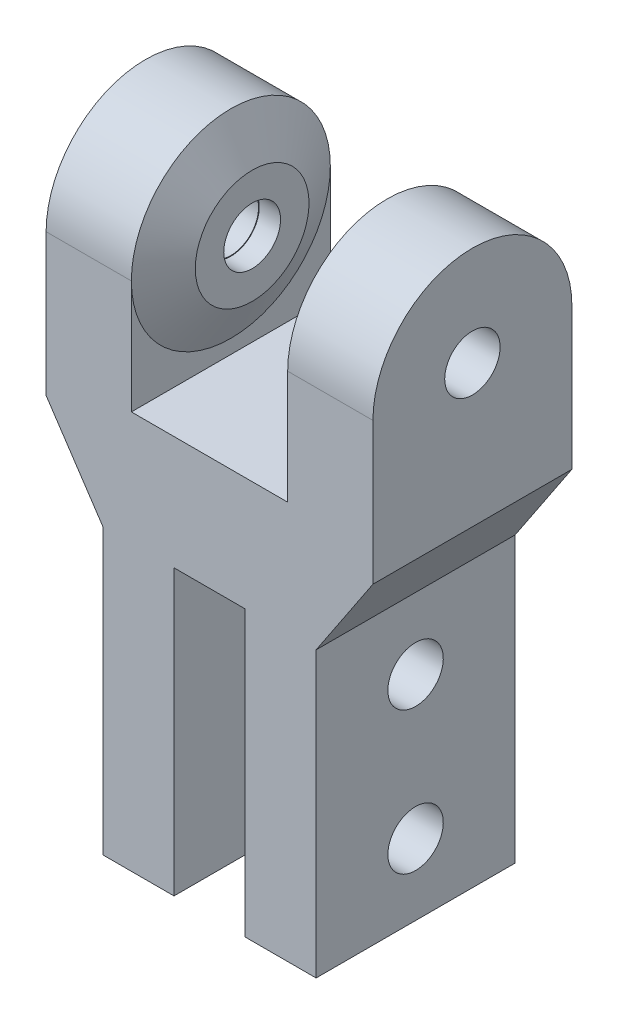
ISO-10303-21;
HEADER;
FILE_DESCRIPTION(('STEP AP214'),'2;1');
FILE_NAME('part.step','',(''),(''),'','','');
FILE_SCHEMA(('AUTOMOTIVE_DESIGN { 1 0 10303 214 1 1 1 1 }'));
ENDSEC;
DATA;
#1=APPLICATION_CONTEXT('core data for automotive mechanical design processes');
#2=APPLICATION_PROTOCOL_DEFINITION('international standard','automotive_design',2000,#1);
#3=PRODUCT_CONTEXT('',#1,'mechanical');
#4=PRODUCT('Part','Part','',(#3));
#5=PRODUCT_RELATED_PRODUCT_CATEGORY('part','',(#4));
#6=PRODUCT_DEFINITION_FORMATION('','',#4);
#7=PRODUCT_DEFINITION_CONTEXT('part definition',#1,'design');
#8=PRODUCT_DEFINITION('design','',#6,#7);
#9=PRODUCT_DEFINITION_SHAPE('','',#8);
#10=(LENGTH_UNIT() NAMED_UNIT(*) SI_UNIT(.MILLI.,.METRE.));
#11=(NAMED_UNIT(*) PLANE_ANGLE_UNIT() SI_UNIT($,.RADIAN.));
#12=(NAMED_UNIT(*) SI_UNIT($,.STERADIAN.) SOLID_ANGLE_UNIT());
#13=UNCERTAINTY_MEASURE_WITH_UNIT(LENGTH_MEASURE(1.E-05),#10,'distance_accuracy_value','');
#14=(GEOMETRIC_REPRESENTATION_CONTEXT(3) GLOBAL_UNCERTAINTY_ASSIGNED_CONTEXT((#13)) GLOBAL_UNIT_ASSIGNED_CONTEXT((#10,
#11,#12)) REPRESENTATION_CONTEXT('',''));
#15=CARTESIAN_POINT('',(0.,0.,0.));
#16=DIRECTION('',(0.,0.,1.));
#17=DIRECTION('',(1.,0.,0.));
#18=AXIS2_PLACEMENT_3D('',#15,#16,#17);
#19=CARTESIAN_POINT('',(2.75,12.,3.5));
#20=DIRECTION('',(1.,0.,0.));
#21=DIRECTION('',(0.,1.,0.));
#22=AXIS2_PLACEMENT_3D('',#19,#20,#21);
#23=PLANE('',#22);
#24=CARTESIAN_POINT('',(2.75,7.99124609126837,0.));
#25=DIRECTION('',(-1.,0.,0.));
#26=DIRECTION('',(0.,0.,1.));
#27=AXIS2_PLACEMENT_3D('',#24,#25,#26);
#28=CIRCLE('',#27,3.5);
#29=CARTESIAN_POINT('',(2.75,7.99124609126837,-3.5));
#30=VERTEX_POINT('',#29);
#31=CARTESIAN_POINT('',(2.75,7.99124609126837,3.5));
#32=VERTEX_POINT('',#31);
#33=EDGE_CURVE('E173',#30,#32,#28,.T.);
#34=ORIENTED_EDGE('',*,*,#33,.F.);
#35=DIRECTION('',(0.,-1.,0.));
#36=VECTOR('',#35,1.);
#37=CARTESIAN_POINT('',(2.75,12.,-3.5));
#38=LINE('',#37,#36);
#39=CARTESIAN_POINT('',(2.75,4.,-3.5));
#40=VERTEX_POINT('',#39);
#41=EDGE_CURVE('E181',#30,#40,#38,.T.);
#42=ORIENTED_EDGE('',*,*,#41,.T.);
#43=DIRECTION('',(0.,0.,-1.));
#44=VECTOR('',#43,1.);
#45=CARTESIAN_POINT('',(2.75,4.,3.5));
#46=LINE('',#45,#44);
#47=CARTESIAN_POINT('',(2.75,4.,3.5));
#48=VERTEX_POINT('',#47);
#49=EDGE_CURVE('E235',#48,#40,#46,.T.);
#50=ORIENTED_EDGE('',*,*,#49,.F.);
#51=DIRECTION('',(0.,-1.,0.));
#52=VECTOR('',#51,1.);
#53=CARTESIAN_POINT('',(2.75,12.,3.5));
#54=LINE('',#53,#52);
#55=EDGE_CURVE('E183',#32,#48,#54,.T.);
#56=ORIENTED_EDGE('',*,*,#55,.F.);
#57=EDGE_LOOP('',(#34,#42,#50,#56));
#58=FACE_BOUND('',#57,.T.);
#59=ADVANCED_FACE('F56',(#58),#23,.F.);
#60=CARTESIAN_POINT('',(2.75,7.99124609126837,0.));
#61=DIRECTION('',(1.,0.,0.));
#62=DIRECTION('',(0.,1.,0.));
#63=AXIS2_PLACEMENT_3D('',#60,#61,#62);
#64=CIRCLE('',#63,0.975);
#65=CARTESIAN_POINT('',(2.75,8.96624609126837,0.));
#66=VERTEX_POINT('',#65);
#67=EDGE_CURVE('E336',#66,#66,#64,.T.);
#68=ORIENTED_EDGE('',*,*,#67,.T.);
#69=EDGE_LOOP('',(#68));
#70=FACE_BOUND('',#69,.T.);
#71=CARTESIAN_POINT('',(2.75,7.99124609126837,0.));
#72=DIRECTION('',(1.,0.,0.));
#73=DIRECTION('',(0.,1.,0.));
#74=AXIS2_PLACEMENT_3D('',#71,#72,#73);
#75=CIRCLE('',#74,1.);
#76=CARTESIAN_POINT('',(2.75,8.99124609126837,0.));
#77=VERTEX_POINT('',#76);
#78=EDGE_CURVE('E12',#77,#77,#75,.T.);
#79=ORIENTED_EDGE('',*,*,#78,.F.);
#80=EDGE_LOOP('',(#79));
#81=FACE_BOUND('',#80,.T.);
#82=ADVANCED_FACE('F389',(#70,#81),#23,.F.);
#83=CARTESIAN_POINT('',(-2.75,12.,3.5));
#84=DIRECTION('',(-1.,0.,0.));
#85=DIRECTION('',(0.,-1.,0.));
#86=AXIS2_PLACEMENT_3D('',#83,#84,#85);
#87=PLANE('',#86);
#88=CARTESIAN_POINT('',(-2.75,7.99124609126837,0.));
#89=DIRECTION('',(-1.,0.,0.));
#90=DIRECTION('',(0.,0.,1.));
#91=AXIS2_PLACEMENT_3D('',#88,#89,#90);
#92=CIRCLE('',#91,3.5);
#93=CARTESIAN_POINT('',(-2.75,7.99124609126837,-3.5));
#94=VERTEX_POINT('',#93);
#95=CARTESIAN_POINT('',(-2.75,7.99124609126837,3.5));
#96=VERTEX_POINT('',#95);
#97=EDGE_CURVE('E78',#94,#96,#92,.T.);
#98=ORIENTED_EDGE('',*,*,#97,.T.);
#99=DIRECTION('',(0.,1.,0.));
#100=VECTOR('',#99,1.);
#101=CARTESIAN_POINT('',(-2.75,12.,3.5));
#102=LINE('',#101,#100);
#103=CARTESIAN_POINT('',(-2.75,4.,3.5));
#104=VERTEX_POINT('',#103);
#105=EDGE_CURVE('E280',#104,#96,#102,.T.);
#106=ORIENTED_EDGE('',*,*,#105,.F.);
#107=DIRECTION('',(0.,0.,-1.));
#108=VECTOR('',#107,1.);
#109=CARTESIAN_POINT('',(-2.75,4.,3.5));
#110=LINE('',#109,#108);
#111=CARTESIAN_POINT('',(-2.75,4.,-3.5));
#112=VERTEX_POINT('',#111);
#113=EDGE_CURVE('E232',#104,#112,#110,.T.);
#114=ORIENTED_EDGE('',*,*,#113,.T.);
#115=DIRECTION('',(0.,1.,0.));
#116=VECTOR('',#115,1.);
#117=CARTESIAN_POINT('',(-2.75,12.,-3.5));
#118=LINE('',#117,#116);
#119=EDGE_CURVE('E202',#112,#94,#118,.T.);
#120=ORIENTED_EDGE('',*,*,#119,.T.);
#121=EDGE_LOOP('',(#98,#106,#114,#120));
#122=FACE_BOUND('',#121,.T.);
#123=ADVANCED_FACE('F275',(#122),#87,.F.);
#124=CARTESIAN_POINT('',(-2.75,7.99124609126837,0.));
#125=DIRECTION('',(-1.,0.,0.));
#126=DIRECTION('',(0.,-1.,0.));
#127=AXIS2_PLACEMENT_3D('',#124,#125,#126);
#128=CIRCLE('',#127,0.975);
#129=CARTESIAN_POINT('',(-2.75,7.01624609126837,0.));
#130=VERTEX_POINT('',#129);
#131=EDGE_CURVE('E265',#130,#130,#128,.T.);
#132=ORIENTED_EDGE('',*,*,#131,.T.);
#133=EDGE_LOOP('',(#132));
#134=FACE_BOUND('',#133,.T.);
#135=CARTESIAN_POINT('',(-2.75,7.99124609126837,0.));
#136=DIRECTION('',(-1.,0.,0.));
#137=DIRECTION('',(0.,-1.,0.));
#138=AXIS2_PLACEMENT_3D('',#135,#136,#137);
#139=CIRCLE('',#138,1.);
#140=CARTESIAN_POINT('',(-2.75,6.99124609126837,0.));
#141=VERTEX_POINT('',#140);
#142=EDGE_CURVE('E64',#141,#141,#139,.T.);
#143=ORIENTED_EDGE('',*,*,#142,.F.);
#144=EDGE_LOOP('',(#143));
#145=FACE_BOUND('',#144,.T.);
#146=ADVANCED_FACE('F402',(#134,#145),#87,.F.);
#147=CARTESIAN_POINT('',(5.75,3.,3.5));
#148=DIRECTION('',(-1.,0.,0.));
#149=DIRECTION('',(0.,-1.,0.));
#150=AXIS2_PLACEMENT_3D('',#147,#148,#149);
#151=PLANE('',#150);
#152=CARTESIAN_POINT('',(5.75,7.99124609126837,0.));
#153=DIRECTION('',(-1.,0.,0.));
#154=DIRECTION('',(0.,-1.,0.));
#155=AXIS2_PLACEMENT_3D('',#152,#153,#154);
#156=CIRCLE('',#155,0.975);
#157=CARTESIAN_POINT('',(5.75,7.01624609126837,0.));
#158=VERTEX_POINT('',#157);
#159=EDGE_CURVE('E303',#158,#158,#156,.T.);
#160=ORIENTED_EDGE('',*,*,#159,.T.);
#161=EDGE_LOOP('',(#160));
#162=FACE_BOUND('',#161,.T.);
#163=CARTESIAN_POINT('',(5.75,7.99124609126837,0.));
#164=DIRECTION('',(-1.,0.,0.));
#165=DIRECTION('',(0.,-1.,0.));
#166=AXIS2_PLACEMENT_3D('',#163,#164,#165);
#167=CIRCLE('',#166,3.5);
#168=CARTESIAN_POINT('',(5.75,7.99124609126837,3.5));
#169=VERTEX_POINT('',#168);
#170=CARTESIAN_POINT('',(5.75,7.99124609126837,-3.5));
#171=VERTEX_POINT('',#170);
#172=EDGE_CURVE('E71',#169,#171,#167,.T.);
#173=ORIENTED_EDGE('',*,*,#172,.F.);
#174=DIRECTION('',(0.,1.,0.));
#175=VECTOR('',#174,1.);
#176=CARTESIAN_POINT('',(5.75,3.,3.5));
#177=LINE('',#176,#175);
#178=CARTESIAN_POINT('',(5.75,3.,3.5));
#179=VERTEX_POINT('',#178);
#180=EDGE_CURVE('E289',#179,#169,#177,.T.);
#181=ORIENTED_EDGE('',*,*,#180,.F.);
#182=DIRECTION('',(0.,0.,-1.));
#183=VECTOR('',#182,1.);
#184=CARTESIAN_POINT('',(5.75,3.,3.5));
#185=LINE('',#184,#183);
#186=CARTESIAN_POINT('',(5.75,3.,-3.5));
#187=VERTEX_POINT('',#186);
#188=EDGE_CURVE('E237',#179,#187,#185,.T.);
#189=ORIENTED_EDGE('',*,*,#188,.T.);
#190=DIRECTION('',(0.,1.,0.));
#191=VECTOR('',#190,1.);
#192=CARTESIAN_POINT('',(5.75,3.,-3.5));
#193=LINE('',#192,#191);
#194=EDGE_CURVE('E200',#187,#171,#193,.T.);
#195=ORIENTED_EDGE('',*,*,#194,.T.);
#196=EDGE_LOOP('',(#173,#181,#189,#195));
#197=FACE_BOUND('',#196,.T.);
#198=ADVANCED_FACE('F319',(#162,#197),#151,.F.);
#199=CARTESIAN_POINT('',(-5.75,3.,3.5));
#200=DIRECTION('',(1.,0.,0.));
#201=DIRECTION('',(0.,0.,-1.));
#202=AXIS2_PLACEMENT_3D('',#199,#200,#201);
#203=PLANE('',#202);
#204=CARTESIAN_POINT('',(-5.75,7.99124609126837,0.));
#205=DIRECTION('',(1.,0.,0.));
#206=DIRECTION('',(0.,0.,-1.));
#207=AXIS2_PLACEMENT_3D('',#204,#205,#206);
#208=CIRCLE('',#207,0.975);
#209=CARTESIAN_POINT('',(-5.75,7.99124609126837,-0.975));
#210=VERTEX_POINT('',#209);
#211=EDGE_CURVE('E263',#210,#210,#208,.T.);
#212=ORIENTED_EDGE('',*,*,#211,.T.);
#213=EDGE_LOOP('',(#212));
#214=FACE_BOUND('',#213,.T.);
#215=CARTESIAN_POINT('',(-5.75,7.99124609126837,0.));
#216=DIRECTION('',(1.,0.,0.));
#217=DIRECTION('',(0.,0.,-1.));
#218=AXIS2_PLACEMENT_3D('',#215,#216,#217);
#219=CIRCLE('',#218,3.5);
#220=CARTESIAN_POINT('',(-5.75,7.99124609126837,-3.5));
#221=VERTEX_POINT('',#220);
#222=CARTESIAN_POINT('',(-5.75,7.99124609126837,3.5));
#223=VERTEX_POINT('',#222);
#224=EDGE_CURVE('E357',#221,#223,#219,.T.);
#225=ORIENTED_EDGE('',*,*,#224,.F.);
#226=DIRECTION('',(0.,-1.,0.));
#227=VECTOR('',#226,1.);
#228=CARTESIAN_POINT('',(-5.75,3.,-3.5));
#229=LINE('',#228,#227);
#230=CARTESIAN_POINT('',(-5.75,3.,-3.5));
#231=VERTEX_POINT('',#230);
#232=EDGE_CURVE('E210',#221,#231,#229,.T.);
#233=ORIENTED_EDGE('',*,*,#232,.T.);
#234=DIRECTION('',(0.,0.,-1.));
#235=VECTOR('',#234,1.);
#236=CARTESIAN_POINT('',(-5.75,3.,3.5));
#237=LINE('',#236,#235);
#238=CARTESIAN_POINT('',(-5.75,3.,3.5));
#239=VERTEX_POINT('',#238);
#240=EDGE_CURVE('E229',#239,#231,#237,.T.);
#241=ORIENTED_EDGE('',*,*,#240,.F.);
#242=DIRECTION('',(0.,-1.,0.));
#243=VECTOR('',#242,1.);
#244=CARTESIAN_POINT('',(-5.75,3.,3.5));
#245=LINE('',#244,#243);
#246=EDGE_CURVE('E287',#223,#239,#245,.T.);
#247=ORIENTED_EDGE('',*,*,#246,.F.);
#248=EDGE_LOOP('',(#225,#233,#241,#247));
#249=FACE_BOUND('',#248,.T.);
#250=ADVANCED_FACE('F401',(#214,#249),#203,.F.);
#251=CARTESIAN_POINT('',(0.,0.,3.5));
#252=DIRECTION('',(0.,0.,-1.));
#253=DIRECTION('',(-1.,0.,0.));
#254=AXIS2_PLACEMENT_3D('',#251,#252,#253);
#255=PLANE('',#254);
#256=DIRECTION('',(1.,0.,0.));
#257=VECTOR('',#256,1.);
#258=CARTESIAN_POINT('',(-7.5,7.99124609126837,3.5));
#259=LINE('',#258,#257);
#260=EDGE_CURVE('E359',#223,#96,#259,.T.);
#261=ORIENTED_EDGE('',*,*,#260,.F.);
#262=ORIENTED_EDGE('',*,*,#246,.T.);
#263=DIRECTION('',(0.554700196225229,-0.832050294337843,0.));
#264=VECTOR('',#263,1.);
#265=CARTESIAN_POINT('',(-3.75,0.,3.5));
#266=LINE('',#265,#264);
#267=CARTESIAN_POINT('',(-3.75,0.,3.5));
#268=VERTEX_POINT('',#267);
#269=EDGE_CURVE('E294',#239,#268,#266,.T.);
#270=ORIENTED_EDGE('',*,*,#269,.T.);
#271=DIRECTION('',(0.,-1.,0.));
#272=VECTOR('',#271,1.);
#273=CARTESIAN_POINT('',(-3.75,-10.,3.5));
#274=LINE('',#273,#272);
#275=CARTESIAN_POINT('',(-3.75,-10.,3.5));
#276=VERTEX_POINT('',#275);
#277=EDGE_CURVE('E296',#268,#276,#274,.T.);
#278=ORIENTED_EDGE('',*,*,#277,.T.);
#279=DIRECTION('',(1.,0.,0.));
#280=VECTOR('',#279,1.);
#281=CARTESIAN_POINT('',(-1.25,-10.,3.5));
#282=LINE('',#281,#280);
#283=CARTESIAN_POINT('',(-1.25,-10.,3.5));
#284=VERTEX_POINT('',#283);
#285=EDGE_CURVE('E223',#276,#284,#282,.T.);
#286=ORIENTED_EDGE('',*,*,#285,.T.);
#287=DIRECTION('',(0.,1.,0.));
#288=VECTOR('',#287,1.);
#289=CARTESIAN_POINT('',(-1.25,0.,3.5));
#290=LINE('',#289,#288);
#291=CARTESIAN_POINT('',(-1.25,0.,3.5));
#292=VERTEX_POINT('',#291);
#293=EDGE_CURVE('E218',#284,#292,#290,.T.);
#294=ORIENTED_EDGE('',*,*,#293,.T.);
#295=DIRECTION('',(1.,0.,0.));
#296=VECTOR('',#295,1.);
#297=CARTESIAN_POINT('',(1.25,0.,3.5));
#298=LINE('',#297,#296);
#299=CARTESIAN_POINT('',(1.25,0.,3.5));
#300=VERTEX_POINT('',#299);
#301=EDGE_CURVE('E330',#292,#300,#298,.T.);
#302=ORIENTED_EDGE('',*,*,#301,.T.);
#303=DIRECTION('',(0.,-1.,0.));
#304=VECTOR('',#303,1.);
#305=CARTESIAN_POINT('',(1.25,0.,3.5));
#306=LINE('',#305,#304);
#307=CARTESIAN_POINT('',(1.25,-10.,3.5));
#308=VERTEX_POINT('',#307);
#309=EDGE_CURVE('E328',#300,#308,#306,.T.);
#310=ORIENTED_EDGE('',*,*,#309,.T.);
#311=DIRECTION('',(1.,0.,0.));
#312=VECTOR('',#311,1.);
#313=CARTESIAN_POINT('',(1.25,-10.,3.5));
#314=LINE('',#313,#312);
#315=CARTESIAN_POINT('',(3.75,-10.,3.5));
#316=VERTEX_POINT('',#315);
#317=EDGE_CURVE('E326',#308,#316,#314,.T.);
#318=ORIENTED_EDGE('',*,*,#317,.T.);
#319=DIRECTION('',(0.,1.,0.));
#320=VECTOR('',#319,1.);
#321=CARTESIAN_POINT('',(3.75,-10.,3.5));
#322=LINE('',#321,#320);
#323=CARTESIAN_POINT('',(3.75,0.,3.5));
#324=VERTEX_POINT('',#323);
#325=EDGE_CURVE('E322',#316,#324,#322,.T.);
#326=ORIENTED_EDGE('',*,*,#325,.T.);
#327=DIRECTION('',(0.554700196225229,0.832050294337844,0.));
#328=VECTOR('',#327,1.);
#329=CARTESIAN_POINT('',(3.75,0.,3.5));
#330=LINE('',#329,#328);
#331=EDGE_CURVE('E321',#324,#179,#330,.T.);
#332=ORIENTED_EDGE('',*,*,#331,.T.);
#333=ORIENTED_EDGE('',*,*,#180,.T.);
#334=EDGE_CURVE('E360',#32,#169,#259,.T.);
#335=ORIENTED_EDGE('',*,*,#334,.F.);
#336=ORIENTED_EDGE('',*,*,#55,.T.);
#337=DIRECTION('',(-1.,0.,0.));
#338=VECTOR('',#337,1.);
#339=CARTESIAN_POINT('',(-2.75,4.,3.5));
#340=LINE('',#339,#338);
#341=EDGE_CURVE('E284',#48,#104,#340,.T.);
#342=ORIENTED_EDGE('',*,*,#341,.T.);
#343=ORIENTED_EDGE('',*,*,#105,.T.);
#344=EDGE_LOOP('',(#261,#262,#270,#278,#286,#294,#302,#310,#318,#326,#332,#333,#335,#336,#342,#343));
#345=FACE_BOUND('',#344,.T.);
#346=ADVANCED_FACE('F437',(#345),#255,.F.);
#347=CARTESIAN_POINT('',(0.,0.,-3.5));
#348=DIRECTION('',(0.,0.,-1.));
#349=DIRECTION('',(-1.,0.,0.));
#350=AXIS2_PLACEMENT_3D('',#347,#348,#349);
#351=PLANE('',#350);
#352=ORIENTED_EDGE('',*,*,#232,.F.);
#353=DIRECTION('',(1.,0.,0.));
#354=VECTOR('',#353,1.);
#355=CARTESIAN_POINT('',(-7.5,7.99124609126837,-3.5));
#356=LINE('',#355,#354);
#357=EDGE_CURVE('E192',#221,#94,#356,.T.);
#358=ORIENTED_EDGE('',*,*,#357,.T.);
#359=ORIENTED_EDGE('',*,*,#119,.F.);
#360=DIRECTION('',(-1.,0.,0.));
#361=VECTOR('',#360,1.);
#362=CARTESIAN_POINT('',(-2.75,4.,-3.5));
#363=LINE('',#362,#361);
#364=EDGE_CURVE('E199',#40,#112,#363,.T.);
#365=ORIENTED_EDGE('',*,*,#364,.F.);
#366=ORIENTED_EDGE('',*,*,#41,.F.);
#367=EDGE_CURVE('E187',#30,#171,#356,.T.);
#368=ORIENTED_EDGE('',*,*,#367,.T.);
#369=ORIENTED_EDGE('',*,*,#194,.F.);
#370=DIRECTION('',(0.554700196225229,0.832050294337844,0.));
#371=VECTOR('',#370,1.);
#372=CARTESIAN_POINT('',(3.75,0.,-3.5));
#373=LINE('',#372,#371);
#374=CARTESIAN_POINT('',(3.75,0.,-3.5));
#375=VERTEX_POINT('',#374);
#376=EDGE_CURVE('E204',#375,#187,#373,.T.);
#377=ORIENTED_EDGE('',*,*,#376,.F.);
#378=DIRECTION('',(0.,1.,0.));
#379=VECTOR('',#378,1.);
#380=CARTESIAN_POINT('',(3.75,-10.,-3.5));
#381=LINE('',#380,#379);
#382=CARTESIAN_POINT('',(3.75,-10.,-3.5));
#383=VERTEX_POINT('',#382);
#384=EDGE_CURVE('E309',#383,#375,#381,.T.);
#385=ORIENTED_EDGE('',*,*,#384,.F.);
#386=DIRECTION('',(1.,0.,0.));
#387=VECTOR('',#386,1.);
#388=CARTESIAN_POINT('',(1.25,-10.,-3.5));
#389=LINE('',#388,#387);
#390=CARTESIAN_POINT('',(1.25,-10.,-3.5));
#391=VERTEX_POINT('',#390);
#392=EDGE_CURVE('E307',#391,#383,#389,.T.);
#393=ORIENTED_EDGE('',*,*,#392,.F.);
#394=DIRECTION('',(0.,-1.,0.));
#395=VECTOR('',#394,1.);
#396=CARTESIAN_POINT('',(1.25,0.,-3.5));
#397=LINE('',#396,#395);
#398=CARTESIAN_POINT('',(1.25,0.,-3.5));
#399=VERTEX_POINT('',#398);
#400=EDGE_CURVE('E305',#399,#391,#397,.T.);
#401=ORIENTED_EDGE('',*,*,#400,.F.);
#402=DIRECTION('',(1.,0.,0.));
#403=VECTOR('',#402,1.);
#404=CARTESIAN_POINT('',(1.25,0.,-3.5));
#405=LINE('',#404,#403);
#406=CARTESIAN_POINT('',(-1.25,0.,-3.5));
#407=VERTEX_POINT('',#406);
#408=EDGE_CURVE('E302',#407,#399,#405,.T.);
#409=ORIENTED_EDGE('',*,*,#408,.F.);
#410=DIRECTION('',(0.,1.,0.));
#411=VECTOR('',#410,1.);
#412=CARTESIAN_POINT('',(-1.25,0.,-3.5));
#413=LINE('',#412,#411);
#414=CARTESIAN_POINT('',(-1.25,-10.,-3.5));
#415=VERTEX_POINT('',#414);
#416=EDGE_CURVE('E299',#415,#407,#413,.T.);
#417=ORIENTED_EDGE('',*,*,#416,.F.);
#418=DIRECTION('',(1.,0.,0.));
#419=VECTOR('',#418,1.);
#420=CARTESIAN_POINT('',(-1.25,-10.,-3.5));
#421=LINE('',#420,#419);
#422=CARTESIAN_POINT('',(-3.75,-10.,-3.5));
#423=VERTEX_POINT('',#422);
#424=EDGE_CURVE('E216',#423,#415,#421,.T.);
#425=ORIENTED_EDGE('',*,*,#424,.F.);
#426=DIRECTION('',(0.,-1.,0.));
#427=VECTOR('',#426,1.);
#428=CARTESIAN_POINT('',(-3.75,-10.,-3.5));
#429=LINE('',#428,#427);
#430=CARTESIAN_POINT('',(-3.75,0.,-3.5));
#431=VERTEX_POINT('',#430);
#432=EDGE_CURVE('E214',#431,#423,#429,.T.);
#433=ORIENTED_EDGE('',*,*,#432,.F.);
#434=DIRECTION('',(0.554700196225229,-0.832050294337843,0.));
#435=VECTOR('',#434,1.);
#436=CARTESIAN_POINT('',(-3.75,0.,-3.5));
#437=LINE('',#436,#435);
#438=EDGE_CURVE('E212',#231,#431,#437,.T.);
#439=ORIENTED_EDGE('',*,*,#438,.F.);
#440=EDGE_LOOP('',(#352,#358,#359,#365,#366,#368,#369,#377,#385,#393,#401,#409,#417,#425,#433,#439));
#441=FACE_BOUND('',#440,.T.);
#442=ADVANCED_FACE('F197',(#441),#351,.T.);
#443=CARTESIAN_POINT('',(-1.25,0.,3.5));
#444=DIRECTION('',(-1.,0.,0.));
#445=DIRECTION('',(0.,-1.,0.));
#446=AXIS2_PLACEMENT_3D('',#443,#444,#445);
#447=PLANE('',#446);
#448=CARTESIAN_POINT('',(-1.25,-7.5,0.));
#449=DIRECTION('',(-1.,0.,0.));
#450=DIRECTION('',(0.,-1.,0.));
#451=AXIS2_PLACEMENT_3D('',#448,#449,#450);
#452=CIRCLE('',#451,0.975);
#453=CARTESIAN_POINT('',(-1.25,-8.475,0.));
#454=VERTEX_POINT('',#453);
#455=EDGE_CURVE('E266',#454,#454,#452,.T.);
#456=ORIENTED_EDGE('',*,*,#455,.T.);
#457=EDGE_LOOP('',(#456));
#458=FACE_BOUND('',#457,.T.);
#459=CARTESIAN_POINT('',(-1.25,-2.5,0.));
#460=DIRECTION('',(-1.,0.,0.));
#461=DIRECTION('',(0.,-1.,0.));
#462=AXIS2_PLACEMENT_3D('',#459,#460,#461);
#463=CIRCLE('',#462,0.975);
#464=CARTESIAN_POINT('',(-1.25,-3.475,0.));
#465=VERTEX_POINT('',#464);
#466=EDGE_CURVE('E262',#465,#465,#463,.T.);
#467=ORIENTED_EDGE('',*,*,#466,.T.);
#468=EDGE_LOOP('',(#467));
#469=FACE_BOUND('',#468,.T.);
#470=ORIENTED_EDGE('',*,*,#416,.T.);
#471=DIRECTION('',(0.,0.,-1.));
#472=VECTOR('',#471,1.);
#473=CARTESIAN_POINT('',(-1.25,0.,3.5));
#474=LINE('',#473,#472);
#475=EDGE_CURVE('E193',#292,#407,#474,.T.);
#476=ORIENTED_EDGE('',*,*,#475,.F.);
#477=ORIENTED_EDGE('',*,*,#293,.F.);
#478=DIRECTION('',(0.,0.,-1.));
#479=VECTOR('',#478,1.);
#480=CARTESIAN_POINT('',(-1.25,-10.,3.5));
#481=LINE('',#480,#479);
#482=EDGE_CURVE('E219',#284,#415,#481,.T.);
#483=ORIENTED_EDGE('',*,*,#482,.T.);
#484=EDGE_LOOP('',(#470,#476,#477,#483));
#485=FACE_BOUND('',#484,.T.);
#486=ADVANCED_FACE('F58',(#458,#469,#485),#447,.F.);
#487=CARTESIAN_POINT('',(1.25,0.,3.5));
#488=DIRECTION('',(0.,1.,0.));
#489=DIRECTION('',(0.,0.,1.));
#490=AXIS2_PLACEMENT_3D('',#487,#488,#489);
#491=PLANE('',#490);
#492=ORIENTED_EDGE('',*,*,#408,.T.);
#493=DIRECTION('',(0.,0.,-1.));
#494=VECTOR('',#493,1.);
#495=CARTESIAN_POINT('',(1.25,0.,3.5));
#496=LINE('',#495,#494);
#497=EDGE_CURVE('E249',#300,#399,#496,.T.);
#498=ORIENTED_EDGE('',*,*,#497,.F.);
#499=ORIENTED_EDGE('',*,*,#301,.F.);
#500=ORIENTED_EDGE('',*,*,#475,.T.);
#501=EDGE_LOOP('',(#492,#498,#499,#500));
#502=FACE_BOUND('',#501,.T.);
#503=ADVANCED_FACE('F416',(#502),#491,.F.);
#504=CARTESIAN_POINT('',(1.25,0.,3.5));
#505=DIRECTION('',(1.,0.,0.));
#506=DIRECTION('',(0.,1.,0.));
#507=AXIS2_PLACEMENT_3D('',#504,#505,#506);
#508=PLANE('',#507);
#509=CARTESIAN_POINT('',(1.25,-7.5,0.));
#510=DIRECTION('',(1.,0.,0.));
#511=DIRECTION('',(0.,1.,0.));
#512=AXIS2_PLACEMENT_3D('',#509,#510,#511);
#513=CIRCLE('',#512,0.975);
#514=CARTESIAN_POINT('',(1.25,-6.525,0.));
#515=VERTEX_POINT('',#514);
#516=EDGE_CURVE('E343',#515,#515,#513,.T.);
#517=ORIENTED_EDGE('',*,*,#516,.T.);
#518=EDGE_LOOP('',(#517));
#519=FACE_BOUND('',#518,.T.);
#520=CARTESIAN_POINT('',(1.25,-2.5,0.));
#521=DIRECTION('',(1.,0.,0.));
#522=DIRECTION('',(0.,1.,0.));
#523=AXIS2_PLACEMENT_3D('',#520,#521,#522);
#524=CIRCLE('',#523,0.975);
#525=CARTESIAN_POINT('',(1.25,-1.525,0.));
#526=VERTEX_POINT('',#525);
#527=EDGE_CURVE('E350',#526,#526,#524,.T.);
#528=ORIENTED_EDGE('',*,*,#527,.T.);
#529=EDGE_LOOP('',(#528));
#530=FACE_BOUND('',#529,.T.);
#531=ORIENTED_EDGE('',*,*,#400,.T.);
#532=DIRECTION('',(0.,0.,-1.));
#533=VECTOR('',#532,1.);
#534=CARTESIAN_POINT('',(1.25,-10.,3.5));
#535=LINE('',#534,#533);
#536=EDGE_CURVE('E246',#308,#391,#535,.T.);
#537=ORIENTED_EDGE('',*,*,#536,.F.);
#538=ORIENTED_EDGE('',*,*,#309,.F.);
#539=ORIENTED_EDGE('',*,*,#497,.T.);
#540=EDGE_LOOP('',(#531,#537,#538,#539));
#541=FACE_BOUND('',#540,.T.);
#542=ADVANCED_FACE('F413',(#519,#530,#541),#508,.F.);
#543=CARTESIAN_POINT('',(1.25,-10.,3.5));
#544=DIRECTION('',(0.,1.,0.));
#545=DIRECTION('',(0.,0.,1.));
#546=AXIS2_PLACEMENT_3D('',#543,#544,#545);
#547=PLANE('',#546);
#548=ORIENTED_EDGE('',*,*,#392,.T.);
#549=DIRECTION('',(0.,0.,-1.));
#550=VECTOR('',#549,1.);
#551=CARTESIAN_POINT('',(3.75,-10.,3.5));
#552=LINE('',#551,#550);
#553=EDGE_CURVE('E243',#316,#383,#552,.T.);
#554=ORIENTED_EDGE('',*,*,#553,.F.);
#555=ORIENTED_EDGE('',*,*,#317,.F.);
#556=ORIENTED_EDGE('',*,*,#536,.T.);
#557=EDGE_LOOP('',(#548,#554,#555,#556));
#558=FACE_BOUND('',#557,.T.);
#559=ADVANCED_FACE('F409',(#558),#547,.F.);
#560=CARTESIAN_POINT('',(3.75,-10.,3.5));
#561=DIRECTION('',(-1.,0.,0.));
#562=DIRECTION('',(0.,0.,1.));
#563=AXIS2_PLACEMENT_3D('',#560,#561,#562);
#564=PLANE('',#563);
#565=CARTESIAN_POINT('',(3.75,-7.5,0.));
#566=DIRECTION('',(-1.,0.,0.));
#567=DIRECTION('',(0.,0.,1.));
#568=AXIS2_PLACEMENT_3D('',#565,#566,#567);
#569=CIRCLE('',#568,0.975);
#570=CARTESIAN_POINT('',(3.75,-7.5,0.975));
#571=VERTEX_POINT('',#570);
#572=EDGE_CURVE('E261',#571,#571,#569,.T.);
#573=ORIENTED_EDGE('',*,*,#572,.T.);
#574=EDGE_LOOP('',(#573));
#575=FACE_BOUND('',#574,.T.);
#576=CARTESIAN_POINT('',(3.75,-2.5,0.));
#577=DIRECTION('',(-1.,0.,0.));
#578=DIRECTION('',(0.,0.,1.));
#579=AXIS2_PLACEMENT_3D('',#576,#577,#578);
#580=CIRCLE('',#579,0.975);
#581=CARTESIAN_POINT('',(3.75,-2.5,0.975));
#582=VERTEX_POINT('',#581);
#583=EDGE_CURVE('E257',#582,#582,#580,.T.);
#584=ORIENTED_EDGE('',*,*,#583,.T.);
#585=EDGE_LOOP('',(#584));
#586=FACE_BOUND('',#585,.T.);
#587=ORIENTED_EDGE('',*,*,#384,.T.);
#588=DIRECTION('',(0.,0.,-1.));
#589=VECTOR('',#588,1.);
#590=CARTESIAN_POINT('',(3.75,0.,3.5));
#591=LINE('',#590,#589);
#592=EDGE_CURVE('E240',#324,#375,#591,.T.);
#593=ORIENTED_EDGE('',*,*,#592,.F.);
#594=ORIENTED_EDGE('',*,*,#325,.F.);
#595=ORIENTED_EDGE('',*,*,#553,.T.);
#596=EDGE_LOOP('',(#587,#593,#594,#595));
#597=FACE_BOUND('',#596,.T.);
#598=ADVANCED_FACE('F406',(#575,#586,#597),#564,.F.);
#599=CARTESIAN_POINT('',(3.75,0.,3.5));
#600=DIRECTION('',(-0.832050294337844,0.554700196225229,0.));
#601=DIRECTION('',(-0.554700196225229,-0.832050294337844,0.));
#602=AXIS2_PLACEMENT_3D('',#599,#600,#601);
#603=PLANE('',#602);
#604=ORIENTED_EDGE('',*,*,#376,.T.);
#605=ORIENTED_EDGE('',*,*,#188,.F.);
#606=ORIENTED_EDGE('',*,*,#331,.F.);
#607=ORIENTED_EDGE('',*,*,#592,.T.);
#608=EDGE_LOOP('',(#604,#605,#606,#607));
#609=FACE_BOUND('',#608,.T.);
#610=ADVANCED_FACE('F313',(#609),#603,.F.);
#611=CARTESIAN_POINT('',(-2.75,4.,3.5));
#612=DIRECTION('',(0.,-1.,0.));
#613=DIRECTION('',(1.,0.,0.));
#614=AXIS2_PLACEMENT_3D('',#611,#612,#613);
#615=PLANE('',#614);
#616=ORIENTED_EDGE('',*,*,#364,.T.);
#617=ORIENTED_EDGE('',*,*,#113,.F.);
#618=ORIENTED_EDGE('',*,*,#341,.F.);
#619=ORIENTED_EDGE('',*,*,#49,.T.);
#620=EDGE_LOOP('',(#616,#617,#618,#619));
#621=FACE_BOUND('',#620,.T.);
#622=ADVANCED_FACE('F283',(#621),#615,.F.);
#623=CARTESIAN_POINT('',(-3.75,0.,3.5));
#624=DIRECTION('',(0.832050294337843,0.554700196225229,0.));
#625=DIRECTION('',(-0.554700196225229,0.832050294337844,0.));
#626=AXIS2_PLACEMENT_3D('',#623,#624,#625);
#627=PLANE('',#626);
#628=ORIENTED_EDGE('',*,*,#438,.T.);
#629=DIRECTION('',(0.,0.,-1.));
#630=VECTOR('',#629,1.);
#631=CARTESIAN_POINT('',(-3.75,0.,3.5));
#632=LINE('',#631,#630);
#633=EDGE_CURVE('E226',#268,#431,#632,.T.);
#634=ORIENTED_EDGE('',*,*,#633,.F.);
#635=ORIENTED_EDGE('',*,*,#269,.F.);
#636=ORIENTED_EDGE('',*,*,#240,.T.);
#637=EDGE_LOOP('',(#628,#634,#635,#636));
#638=FACE_BOUND('',#637,.T.);
#639=ADVANCED_FACE('F453',(#638),#627,.F.);
#640=CARTESIAN_POINT('',(-3.75,-10.,3.5));
#641=DIRECTION('',(1.,0.,0.));
#642=DIRECTION('',(0.,0.,-1.));
#643=AXIS2_PLACEMENT_3D('',#640,#641,#642);
#644=PLANE('',#643);
#645=CARTESIAN_POINT('',(-3.75,-7.5,0.));
#646=DIRECTION('',(1.,0.,0.));
#647=DIRECTION('',(0.,0.,-1.));
#648=AXIS2_PLACEMENT_3D('',#645,#646,#647);
#649=CIRCLE('',#648,0.975);
#650=CARTESIAN_POINT('',(-3.75,-7.5,-0.975));
#651=VERTEX_POINT('',#650);
#652=EDGE_CURVE('E258',#651,#651,#649,.T.);
#653=ORIENTED_EDGE('',*,*,#652,.T.);
#654=EDGE_LOOP('',(#653));
#655=FACE_BOUND('',#654,.T.);
#656=CARTESIAN_POINT('',(-3.75,-2.5,0.));
#657=DIRECTION('',(1.,0.,0.));
#658=DIRECTION('',(0.,0.,-1.));
#659=AXIS2_PLACEMENT_3D('',#656,#657,#658);
#660=CIRCLE('',#659,0.975);
#661=CARTESIAN_POINT('',(-3.75,-2.5,-0.975));
#662=VERTEX_POINT('',#661);
#663=EDGE_CURVE('E254',#662,#662,#660,.T.);
#664=ORIENTED_EDGE('',*,*,#663,.T.);
#665=EDGE_LOOP('',(#664));
#666=FACE_BOUND('',#665,.T.);
#667=ORIENTED_EDGE('',*,*,#432,.T.);
#668=DIRECTION('',(0.,0.,-1.));
#669=VECTOR('',#668,1.);
#670=CARTESIAN_POINT('',(-3.75,-10.,3.5));
#671=LINE('',#670,#669);
#672=EDGE_CURVE('E222',#276,#423,#671,.T.);
#673=ORIENTED_EDGE('',*,*,#672,.F.);
#674=ORIENTED_EDGE('',*,*,#277,.F.);
#675=ORIENTED_EDGE('',*,*,#633,.T.);
#676=EDGE_LOOP('',(#667,#673,#674,#675));
#677=FACE_BOUND('',#676,.T.);
#678=ADVANCED_FACE('F449',(#655,#666,#677),#644,.F.);
#679=CARTESIAN_POINT('',(-1.25,-10.,3.5));
#680=DIRECTION('',(0.,1.,0.));
#681=DIRECTION('',(0.,0.,1.));
#682=AXIS2_PLACEMENT_3D('',#679,#680,#681);
#683=PLANE('',#682);
#684=ORIENTED_EDGE('',*,*,#424,.T.);
#685=ORIENTED_EDGE('',*,*,#482,.F.);
#686=ORIENTED_EDGE('',*,*,#285,.F.);
#687=ORIENTED_EDGE('',*,*,#672,.T.);
#688=EDGE_LOOP('',(#684,#685,#686,#687));
#689=FACE_BOUND('',#688,.T.);
#690=ADVANCED_FACE('F445',(#689),#683,.F.);
#691=CARTESIAN_POINT('',(-7.5,7.99124609126837,0.));
#692=DIRECTION('',(1.,0.,0.));
#693=DIRECTION('',(0.,0.,-1.));
#694=AXIS2_PLACEMENT_3D('',#691,#692,#693);
#695=CYLINDRICAL_SURFACE('',#694,3.5);
#696=ORIENTED_EDGE('',*,*,#172,.T.);
#697=ORIENTED_EDGE('',*,*,#367,.F.);
#698=CARTESIAN_POINT('',(2.75,7.99124609126837,0.));
#699=DIRECTION('',(1.,0.,0.));
#700=DIRECTION('',(0.,1.,0.));
#701=AXIS2_PLACEMENT_3D('',#698,#699,#700);
#702=CIRCLE('',#701,3.5);
#703=EDGE_CURVE('E169',#30,#32,#702,.T.);
#704=ORIENTED_EDGE('',*,*,#703,.T.);
#705=ORIENTED_EDGE('',*,*,#334,.T.);
#706=EDGE_LOOP('',(#696,#697,#704,#705));
#707=FACE_BOUND('',#706,.T.);
#708=ADVANCED_FACE('F188',(#707),#695,.T.);
#709=CARTESIAN_POINT('',(-2.75,7.99124609126837,0.));
#710=DIRECTION('',(-1.,0.,0.));
#711=DIRECTION('',(0.,-1.,0.));
#712=AXIS2_PLACEMENT_3D('',#709,#710,#711);
#713=CIRCLE('',#712,3.5);
#714=EDGE_CURVE('E175',#96,#94,#713,.T.);
#715=ORIENTED_EDGE('',*,*,#714,.T.);
#716=ORIENTED_EDGE('',*,*,#357,.F.);
#717=ORIENTED_EDGE('',*,*,#224,.T.);
#718=ORIENTED_EDGE('',*,*,#260,.T.);
#719=EDGE_LOOP('',(#715,#716,#717,#718));
#720=FACE_BOUND('',#719,.T.);
#721=ADVANCED_FACE('F457',(#720),#695,.T.);
#722=CARTESIAN_POINT('',(-7.5,-2.5,0.));
#723=DIRECTION('',(1.,0.,0.));
#724=DIRECTION('',(0.,0.,-1.));
#725=AXIS2_PLACEMENT_3D('',#722,#723,#724);
#726=CYLINDRICAL_SURFACE('',#725,0.975);
#727=ORIENTED_EDGE('',*,*,#663,.F.);
#728=EDGE_LOOP('',(#727));
#729=FACE_BOUND('',#728,.T.);
#730=ORIENTED_EDGE('',*,*,#466,.F.);
#731=EDGE_LOOP('',(#730));
#732=FACE_BOUND('',#731,.T.);
#733=ADVANCED_FACE('F481',(#729,#732),#726,.F.);
#734=CARTESIAN_POINT('',(-7.5,-7.5,0.));
#735=DIRECTION('',(1.,0.,0.));
#736=DIRECTION('',(0.,0.,-1.));
#737=AXIS2_PLACEMENT_3D('',#734,#735,#736);
#738=CYLINDRICAL_SURFACE('',#737,0.975);
#739=ORIENTED_EDGE('',*,*,#652,.F.);
#740=EDGE_LOOP('',(#739));
#741=FACE_BOUND('',#740,.T.);
#742=ORIENTED_EDGE('',*,*,#455,.F.);
#743=EDGE_LOOP('',(#742));
#744=FACE_BOUND('',#743,.T.);
#745=ADVANCED_FACE('F484',(#741,#744),#738,.F.);
#746=CARTESIAN_POINT('',(-7.5,7.99124609126837,0.));
#747=DIRECTION('',(1.,0.,0.));
#748=DIRECTION('',(0.,0.,-1.));
#749=AXIS2_PLACEMENT_3D('',#746,#747,#748);
#750=CYLINDRICAL_SURFACE('',#749,0.975);
#751=ORIENTED_EDGE('',*,*,#211,.F.);
#752=EDGE_LOOP('',(#751));
#753=FACE_BOUND('',#752,.T.);
#754=ORIENTED_EDGE('',*,*,#131,.F.);
#755=EDGE_LOOP('',(#754));
#756=FACE_BOUND('',#755,.T.);
#757=ADVANCED_FACE('F479',(#753,#756),#750,.F.);
#758=ORIENTED_EDGE('',*,*,#67,.F.);
#759=EDGE_LOOP('',(#758));
#760=FACE_BOUND('',#759,.T.);
#761=ORIENTED_EDGE('',*,*,#159,.F.);
#762=EDGE_LOOP('',(#761));
#763=FACE_BOUND('',#762,.T.);
#764=ADVANCED_FACE('F475',(#760,#763),#750,.F.);
#765=ORIENTED_EDGE('',*,*,#583,.F.);
#766=EDGE_LOOP('',(#765));
#767=FACE_BOUND('',#766,.T.);
#768=ORIENTED_EDGE('',*,*,#527,.F.);
#769=EDGE_LOOP('',(#768));
#770=FACE_BOUND('',#769,.T.);
#771=ADVANCED_FACE('F478',(#767,#770),#726,.F.);
#772=ORIENTED_EDGE('',*,*,#572,.F.);
#773=EDGE_LOOP('',(#772));
#774=FACE_BOUND('',#773,.T.);
#775=ORIENTED_EDGE('',*,*,#516,.F.);
#776=EDGE_LOOP('',(#775));
#777=FACE_BOUND('',#776,.T.);
#778=ADVANCED_FACE('F462',(#774,#777),#738,.F.);
#779=CARTESIAN_POINT('',(-2.,7.99124609126837,0.));
#780=DIRECTION('',(-1.,0.,0.));
#781=DIRECTION('',(0.,0.,1.));
#782=AXIS2_PLACEMENT_3D('',#779,#780,#781);
#783=CONICAL_SURFACE('',#782,2.,1.10714871779409);
#784=ORIENTED_EDGE('',*,*,#714,.F.);
#785=ORIENTED_EDGE('',*,*,#97,.F.);
#786=EDGE_LOOP('',(#784,#785));
#787=FACE_BOUND('',#786,.T.);
#788=CARTESIAN_POINT('',(-2.,7.99124609126837,0.));
#789=DIRECTION('',(-1.,0.,0.));
#790=DIRECTION('',(0.,0.,1.));
#791=AXIS2_PLACEMENT_3D('',#788,#789,#790);
#792=CIRCLE('',#791,2.);
#793=CARTESIAN_POINT('',(-2.,7.99124609126837,2.));
#794=VERTEX_POINT('',#793);
#795=EDGE_CURVE('E363',#794,#794,#792,.T.);
#796=ORIENTED_EDGE('',*,*,#795,.T.);
#797=EDGE_LOOP('',(#796));
#798=FACE_BOUND('',#797,.T.);
#799=ADVANCED_FACE('F458',(#787,#798),#783,.T.);
#800=CARTESIAN_POINT('',(-2.,8.99124609126837,0.));
#801=DIRECTION('',(-1.,0.,0.));
#802=DIRECTION('',(0.,0.,1.));
#803=AXIS2_PLACEMENT_3D('',#800,#801,#802);
#804=PLANE('',#803);
#805=ORIENTED_EDGE('',*,*,#795,.F.);
#806=EDGE_LOOP('',(#805));
#807=FACE_BOUND('',#806,.T.);
#808=CARTESIAN_POINT('',(-2.,7.99124609126837,0.));
#809=DIRECTION('',(-1.,0.,0.));
#810=DIRECTION('',(0.,0.,1.));
#811=AXIS2_PLACEMENT_3D('',#808,#809,#810);
#812=CIRCLE('',#811,1.);
#813=CARTESIAN_POINT('',(-2.,7.99124609126837,1.));
#814=VERTEX_POINT('',#813);
#815=EDGE_CURVE('E184',#814,#814,#812,.T.);
#816=ORIENTED_EDGE('',*,*,#815,.T.);
#817=EDGE_LOOP('',(#816));
#818=FACE_BOUND('',#817,.T.);
#819=ADVANCED_FACE('F461',(#807,#818),#804,.F.);
#820=CARTESIAN_POINT('',(-5.75,7.99124609126837,0.));
#821=DIRECTION('',(-1.,0.,0.));
#822=DIRECTION('',(0.,0.,1.));
#823=AXIS2_PLACEMENT_3D('',#820,#821,#822);
#824=CYLINDRICAL_SURFACE('',#823,1.);
#825=ORIENTED_EDGE('',*,*,#815,.F.);
#826=EDGE_LOOP('',(#825));
#827=FACE_BOUND('',#826,.T.);
#828=ORIENTED_EDGE('',*,*,#142,.T.);
#829=EDGE_LOOP('',(#828));
#830=FACE_BOUND('',#829,.T.);
#831=ADVANCED_FACE('F386',(#827,#830),#824,.F.);
#832=CARTESIAN_POINT('',(2.,7.99124609126837,0.));
#833=DIRECTION('',(1.,0.,0.));
#834=DIRECTION('',(0.,0.,1.));
#835=AXIS2_PLACEMENT_3D('',#832,#833,#834);
#836=CONICAL_SURFACE('',#835,2.,1.10714871779409);
#837=ORIENTED_EDGE('',*,*,#703,.F.);
#838=ORIENTED_EDGE('',*,*,#33,.T.);
#839=EDGE_LOOP('',(#837,#838));
#840=FACE_BOUND('',#839,.T.);
#841=CARTESIAN_POINT('',(2.,7.99124609126837,0.));
#842=DIRECTION('',(-1.,0.,0.));
#843=DIRECTION('',(0.,0.,1.));
#844=AXIS2_PLACEMENT_3D('',#841,#842,#843);
#845=CIRCLE('',#844,2.);
#846=CARTESIAN_POINT('',(2.,7.99124609126837,2.));
#847=VERTEX_POINT('',#846);
#848=EDGE_CURVE('E185',#847,#847,#845,.T.);
#849=ORIENTED_EDGE('',*,*,#848,.F.);
#850=EDGE_LOOP('',(#849));
#851=FACE_BOUND('',#850,.T.);
#852=ADVANCED_FACE('F171',(#840,#851),#836,.T.);
#853=CARTESIAN_POINT('',(2.,8.99124609126837,0.));
#854=DIRECTION('',(1.,0.,0.));
#855=DIRECTION('',(0.,0.,1.));
#856=AXIS2_PLACEMENT_3D('',#853,#854,#855);
#857=PLANE('',#856);
#858=ORIENTED_EDGE('',*,*,#848,.T.);
#859=EDGE_LOOP('',(#858));
#860=FACE_BOUND('',#859,.T.);
#861=CARTESIAN_POINT('',(2.,7.99124609126837,0.));
#862=DIRECTION('',(-1.,0.,0.));
#863=DIRECTION('',(0.,0.,1.));
#864=AXIS2_PLACEMENT_3D('',#861,#862,#863);
#865=CIRCLE('',#864,1.);
#866=CARTESIAN_POINT('',(2.,7.99124609126837,1.));
#867=VERTEX_POINT('',#866);
#868=EDGE_CURVE('E370',#867,#867,#865,.T.);
#869=ORIENTED_EDGE('',*,*,#868,.F.);
#870=EDGE_LOOP('',(#869));
#871=FACE_BOUND('',#870,.T.);
#872=ADVANCED_FACE('F377',(#860,#871),#857,.F.);
#873=CARTESIAN_POINT('',(5.75,7.99124609126837,0.));
#874=DIRECTION('',(1.,0.,0.));
#875=DIRECTION('',(0.,0.,1.));
#876=AXIS2_PLACEMENT_3D('',#873,#874,#875);
#877=CYLINDRICAL_SURFACE('',#876,1.);
#878=ORIENTED_EDGE('',*,*,#868,.T.);
#879=EDGE_LOOP('',(#878));
#880=FACE_BOUND('',#879,.T.);
#881=ORIENTED_EDGE('',*,*,#78,.T.);
#882=EDGE_LOOP('',(#881));
#883=FACE_BOUND('',#882,.T.);
#884=ADVANCED_FACE('F374',(#880,#883),#877,.F.);
#885=CLOSED_SHELL('',(#59,#82,#123,#146,#198,#250,#346,#442,#486,#503,#542,#559,#598,#610,#622,
#639,#678,#690,#708,#721,#733,#745,#757,#764,#771,#778,#799,#819,#831,#852,#872,#884));
#886=MANIFOLD_SOLID_BREP('B2',#885);
#887=ADVANCED_BREP_SHAPE_REPRESENTATION('',(#18,#886),#14);
#888=SHAPE_DEFINITION_REPRESENTATION(#9,#887);
ENDSEC;
END-ISO-10303-21;
